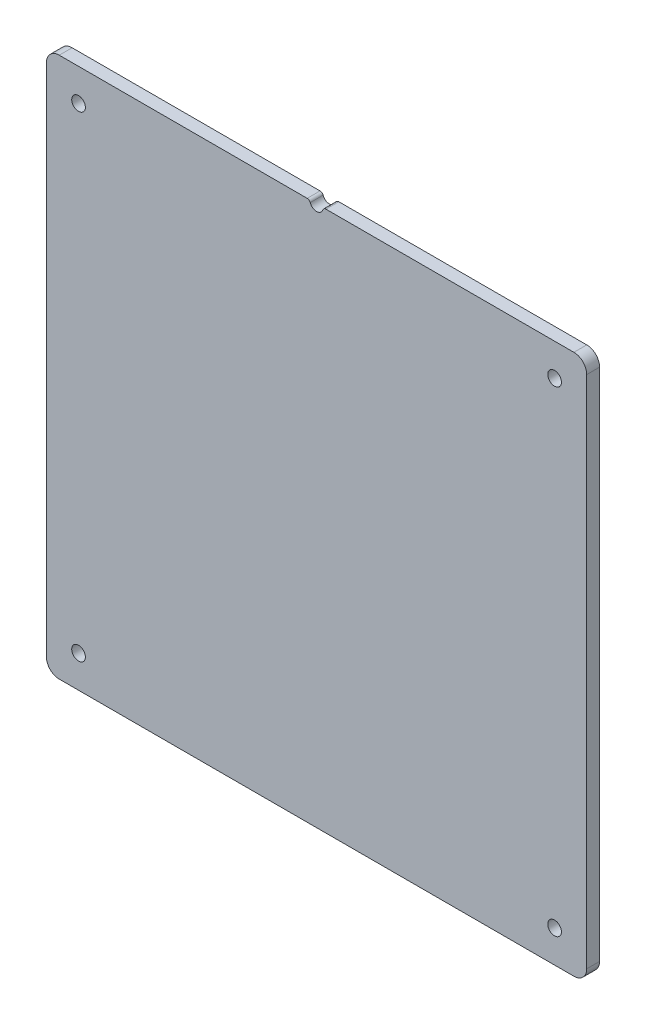
ISO-10303-21;
HEADER;
FILE_DESCRIPTION(('STEP AP214'),'2;1');
FILE_NAME('part.step','',(''),(''),'','','');
FILE_SCHEMA(('AUTOMOTIVE_DESIGN { 1 0 10303 214 1 1 1 1 }'));
ENDSEC;
DATA;
#1=APPLICATION_CONTEXT('core data for automotive mechanical design processes');
#2=APPLICATION_PROTOCOL_DEFINITION('international standard','automotive_design',2000,#1);
#3=PRODUCT_CONTEXT('',#1,'mechanical');
#4=PRODUCT('Part','Part','',(#3));
#5=PRODUCT_RELATED_PRODUCT_CATEGORY('part','',(#4));
#6=PRODUCT_DEFINITION_FORMATION('','',#4);
#7=PRODUCT_DEFINITION_CONTEXT('part definition',#1,'design');
#8=PRODUCT_DEFINITION('design','',#6,#7);
#9=PRODUCT_DEFINITION_SHAPE('','',#8);
#10=(LENGTH_UNIT() NAMED_UNIT(*) SI_UNIT(.MILLI.,.METRE.));
#11=(NAMED_UNIT(*) PLANE_ANGLE_UNIT() SI_UNIT($,.RADIAN.));
#12=(NAMED_UNIT(*) SI_UNIT($,.STERADIAN.) SOLID_ANGLE_UNIT());
#13=UNCERTAINTY_MEASURE_WITH_UNIT(LENGTH_MEASURE(1.E-05),#10,'distance_accuracy_value','');
#14=(GEOMETRIC_REPRESENTATION_CONTEXT(3) GLOBAL_UNCERTAINTY_ASSIGNED_CONTEXT((#13)) GLOBAL_UNIT_ASSIGNED_CONTEXT((#10,
#11,#12)) REPRESENTATION_CONTEXT('',''));
#15=CARTESIAN_POINT('',(0.,0.,0.));
#16=DIRECTION('',(0.,0.,1.));
#17=DIRECTION('',(1.,0.,0.));
#18=AXIS2_PLACEMENT_3D('',#15,#16,#17);
#19=CARTESIAN_POINT('',(-133.35,133.35,6.35));
#20=DIRECTION('',(0.,-1.,0.));
#21=DIRECTION('',(0.,0.,-1.));
#22=AXIS2_PLACEMENT_3D('',#19,#20,#21);
#23=PLANE('',#22);
#24=DIRECTION('',(-1.,0.,0.));
#25=VECTOR('',#24,1.);
#26=CARTESIAN_POINT('',(-133.35,133.35,0.));
#27=LINE('',#26,#25);
#28=CARTESIAN_POINT('',(127.,133.35,0.));
#29=VERTEX_POINT('',#28);
#30=CARTESIAN_POINT('',(4.6246139298324,133.35,0.));
#31=VERTEX_POINT('',#30);
#32=EDGE_CURVE('E163',#29,#31,#27,.T.);
#33=ORIENTED_EDGE('',*,*,#32,.T.);
#34=DIRECTION('',(0.,0.,1.));
#35=VECTOR('',#34,1.);
#36=CARTESIAN_POINT('',(4.6246139298324,133.35,6.35));
#37=LINE('',#36,#35);
#38=CARTESIAN_POINT('',(4.6246139298324,133.35,6.35));
#39=VERTEX_POINT('',#38);
#40=EDGE_CURVE('E205',#31,#39,#37,.T.);
#41=ORIENTED_EDGE('',*,*,#40,.T.);
#42=DIRECTION('',(-1.,0.,0.));
#43=VECTOR('',#42,1.);
#44=CARTESIAN_POINT('',(-133.35,133.35,6.35));
#45=LINE('',#44,#43);
#46=CARTESIAN_POINT('',(127.,133.35,6.35));
#47=VERTEX_POINT('',#46);
#48=EDGE_CURVE('E230',#47,#39,#45,.T.);
#49=ORIENTED_EDGE('',*,*,#48,.F.);
#50=DIRECTION('',(0.,0.,-1.));
#51=VECTOR('',#50,1.);
#52=CARTESIAN_POINT('',(127.,133.35,6.35));
#53=LINE('',#52,#51);
#54=EDGE_CURVE('E202',#47,#29,#53,.T.);
#55=ORIENTED_EDGE('',*,*,#54,.T.);
#56=EDGE_LOOP('',(#33,#41,#49,#55));
#57=FACE_BOUND('',#56,.T.);
#58=ADVANCED_FACE('F41',(#57),#23,.F.);
#59=CARTESIAN_POINT('',(0.,0.,6.35));
#60=DIRECTION('',(0.,0.,-1.));
#61=DIRECTION('',(-1.,0.,0.));
#62=AXIS2_PLACEMENT_3D('',#59,#60,#61);
#63=PLANE('',#62);
#64=CARTESIAN_POINT('',(-117.475,-117.475,6.35));
#65=DIRECTION('',(0.,0.,1.));
#66=DIRECTION('',(1.,0.,0.));
#67=AXIS2_PLACEMENT_3D('',#64,#65,#66);
#68=CIRCLE('',#67,3.37819999999998);
#69=CARTESIAN_POINT('',(-114.0968,-117.475,6.35));
#70=VERTEX_POINT('',#69);
#71=EDGE_CURVE('E241',#70,#70,#68,.T.);
#72=ORIENTED_EDGE('',*,*,#71,.F.);
#73=EDGE_LOOP('',(#72));
#74=FACE_BOUND('',#73,.T.);
#75=CARTESIAN_POINT('',(117.475,-117.475,6.35));
#76=DIRECTION('',(0.,0.,1.));
#77=DIRECTION('',(1.,0.,0.));
#78=AXIS2_PLACEMENT_3D('',#75,#76,#77);
#79=CIRCLE('',#78,3.37819999999998);
#80=CARTESIAN_POINT('',(120.8532,-117.475,6.35));
#81=VERTEX_POINT('',#80);
#82=EDGE_CURVE('E247',#81,#81,#79,.T.);
#83=ORIENTED_EDGE('',*,*,#82,.F.);
#84=EDGE_LOOP('',(#83));
#85=FACE_BOUND('',#84,.T.);
#86=CARTESIAN_POINT('',(117.475,117.475,6.35));
#87=DIRECTION('',(0.,0.,1.));
#88=DIRECTION('',(1.,0.,0.));
#89=AXIS2_PLACEMENT_3D('',#86,#87,#88);
#90=CIRCLE('',#89,3.37819999999998);
#91=CARTESIAN_POINT('',(120.8532,117.475,6.35));
#92=VERTEX_POINT('',#91);
#93=EDGE_CURVE('E166',#92,#92,#90,.T.);
#94=ORIENTED_EDGE('',*,*,#93,.F.);
#95=EDGE_LOOP('',(#94));
#96=FACE_BOUND('',#95,.T.);
#97=ORIENTED_EDGE('',*,*,#48,.T.);
#98=CARTESIAN_POINT('',(4.62461392983241,131.7625,6.35));
#99=DIRECTION('',(0.,0.,-1.));
#100=DIRECTION('',(-1.,0.,0.));
#101=AXIS2_PLACEMENT_3D('',#98,#99,#100);
#102=CIRCLE('',#101,1.5875);
#103=CARTESIAN_POINT('',(3.12311590066604,132.277922077922,6.35));
#104=VERTEX_POINT('',#103);
#105=EDGE_CURVE('E210',#39,#104,#102,.F.);
#106=ORIENTED_EDGE('',*,*,#105,.T.);
#107=CARTESIAN_POINT('',(0.,133.35,6.35));
#108=DIRECTION('',(0.,0.,1.));
#109=DIRECTION('',(1.,0.,0.));
#110=AXIS2_PLACEMENT_3D('',#107,#108,#109);
#111=CIRCLE('',#110,3.302);
#112=CARTESIAN_POINT('',(-3.12311590066604,132.277922077922,6.35));
#113=VERTEX_POINT('',#112);
#114=EDGE_CURVE('E228',#113,#104,#111,.T.);
#115=ORIENTED_EDGE('',*,*,#114,.F.);
#116=CARTESIAN_POINT('',(-4.62461392983241,131.7625,6.35));
#117=DIRECTION('',(0.,0.,-1.));
#118=DIRECTION('',(-1.,0.,0.));
#119=AXIS2_PLACEMENT_3D('',#116,#117,#118);
#120=CIRCLE('',#119,1.5875);
#121=CARTESIAN_POINT('',(-4.6246139298324,133.35,6.35));
#122=VERTEX_POINT('',#121);
#123=EDGE_CURVE('E208',#113,#122,#120,.F.);
#124=ORIENTED_EDGE('',*,*,#123,.T.);
#125=CARTESIAN_POINT('',(-127.,133.35,6.35));
#126=VERTEX_POINT('',#125);
#127=EDGE_CURVE('E256',#122,#126,#45,.T.);
#128=ORIENTED_EDGE('',*,*,#127,.T.);
#129=CARTESIAN_POINT('',(-127.,127.,6.35));
#130=DIRECTION('',(0.,0.,-1.));
#131=DIRECTION('',(-1.,0.,0.));
#132=AXIS2_PLACEMENT_3D('',#129,#130,#131);
#133=CIRCLE('',#132,6.35);
#134=CARTESIAN_POINT('',(-133.35,127.,6.35));
#135=VERTEX_POINT('',#134);
#136=EDGE_CURVE('E186',#126,#135,#133,.F.);
#137=ORIENTED_EDGE('',*,*,#136,.T.);
#138=DIRECTION('',(0.,-1.,0.));
#139=VECTOR('',#138,1.);
#140=CARTESIAN_POINT('',(-133.35,-133.35,6.35));
#141=LINE('',#140,#139);
#142=CARTESIAN_POINT('',(-133.35,-127.,6.35));
#143=VERTEX_POINT('',#142);
#144=EDGE_CURVE('E257',#135,#143,#141,.T.);
#145=ORIENTED_EDGE('',*,*,#144,.T.);
#146=CARTESIAN_POINT('',(-127.,-127.,6.35));
#147=DIRECTION('',(0.,0.,-1.));
#148=DIRECTION('',(-1.,0.,0.));
#149=AXIS2_PLACEMENT_3D('',#146,#147,#148);
#150=CIRCLE('',#149,6.35);
#151=CARTESIAN_POINT('',(-127.,-133.35,6.35));
#152=VERTEX_POINT('',#151);
#153=EDGE_CURVE('E190',#143,#152,#150,.F.);
#154=ORIENTED_EDGE('',*,*,#153,.T.);
#155=DIRECTION('',(1.,0.,0.));
#156=VECTOR('',#155,1.);
#157=CARTESIAN_POINT('',(-133.35,-133.35,6.35));
#158=LINE('',#157,#156);
#159=CARTESIAN_POINT('',(127.,-133.35,6.35));
#160=VERTEX_POINT('',#159);
#161=EDGE_CURVE('E169',#152,#160,#158,.T.);
#162=ORIENTED_EDGE('',*,*,#161,.T.);
#163=CARTESIAN_POINT('',(127.,-127.,6.35));
#164=DIRECTION('',(0.,0.,-1.));
#165=DIRECTION('',(-1.,0.,0.));
#166=AXIS2_PLACEMENT_3D('',#163,#164,#165);
#167=CIRCLE('',#166,6.35);
#168=CARTESIAN_POINT('',(133.35,-127.,6.35));
#169=VERTEX_POINT('',#168);
#170=EDGE_CURVE('E192',#160,#169,#167,.F.);
#171=ORIENTED_EDGE('',*,*,#170,.T.);
#172=DIRECTION('',(0.,1.,0.));
#173=VECTOR('',#172,1.);
#174=CARTESIAN_POINT('',(133.35,-133.35,6.35));
#175=LINE('',#174,#173);
#176=CARTESIAN_POINT('',(133.35,127.,6.35));
#177=VERTEX_POINT('',#176);
#178=EDGE_CURVE('E152',#169,#177,#175,.T.);
#179=ORIENTED_EDGE('',*,*,#178,.T.);
#180=CARTESIAN_POINT('',(127.,127.,6.35));
#181=DIRECTION('',(0.,0.,-1.));
#182=DIRECTION('',(-1.,0.,0.));
#183=AXIS2_PLACEMENT_3D('',#180,#181,#182);
#184=CIRCLE('',#183,6.35);
#185=EDGE_CURVE('E188',#177,#47,#184,.F.);
#186=ORIENTED_EDGE('',*,*,#185,.T.);
#187=EDGE_LOOP('',(#97,#106,#115,#124,#128,#137,#145,#154,#162,#171,#179,#186));
#188=FACE_BOUND('',#187,.T.);
#189=CARTESIAN_POINT('',(-117.475,117.475,6.35));
#190=DIRECTION('',(0.,0.,1.));
#191=DIRECTION('',(1.,0.,0.));
#192=AXIS2_PLACEMENT_3D('',#189,#190,#191);
#193=CIRCLE('',#192,3.37819999999998);
#194=CARTESIAN_POINT('',(-114.0968,117.475,6.35));
#195=VERTEX_POINT('',#194);
#196=EDGE_CURVE('E233',#195,#195,#193,.T.);
#197=ORIENTED_EDGE('',*,*,#196,.F.);
#198=EDGE_LOOP('',(#197));
#199=FACE_BOUND('',#198,.T.);
#200=ADVANCED_FACE('F226',(#74,#85,#96,#188,#199),#63,.F.);
#201=CARTESIAN_POINT('',(0.,0.,0.));
#202=DIRECTION('',(0.,0.,-1.));
#203=DIRECTION('',(-1.,0.,0.));
#204=AXIS2_PLACEMENT_3D('',#201,#202,#203);
#205=PLANE('',#204);
#206=CARTESIAN_POINT('',(0.,133.35,0.));
#207=DIRECTION('',(0.,0.,1.));
#208=DIRECTION('',(1.,0.,0.));
#209=AXIS2_PLACEMENT_3D('',#206,#207,#208);
#210=CIRCLE('',#209,3.302);
#211=CARTESIAN_POINT('',(-3.12311590066604,132.277922077922,0.));
#212=VERTEX_POINT('',#211);
#213=CARTESIAN_POINT('',(3.12311590066604,132.277922077922,0.));
#214=VERTEX_POINT('',#213);
#215=EDGE_CURVE('E216',#212,#214,#210,.T.);
#216=ORIENTED_EDGE('',*,*,#215,.T.);
#217=CARTESIAN_POINT('',(4.62461392983241,131.7625,0.));
#218=DIRECTION('',(0.,0.,-1.));
#219=DIRECTION('',(-1.,0.,0.));
#220=AXIS2_PLACEMENT_3D('',#217,#218,#219);
#221=CIRCLE('',#220,1.5875);
#222=EDGE_CURVE('E49',#214,#31,#221,.T.);
#223=ORIENTED_EDGE('',*,*,#222,.T.);
#224=ORIENTED_EDGE('',*,*,#32,.F.);
#225=CARTESIAN_POINT('',(127.,127.,0.));
#226=DIRECTION('',(0.,0.,-1.));
#227=DIRECTION('',(-1.,0.,0.));
#228=AXIS2_PLACEMENT_3D('',#225,#226,#227);
#229=CIRCLE('',#228,6.35);
#230=CARTESIAN_POINT('',(133.35,127.,0.));
#231=VERTEX_POINT('',#230);
#232=EDGE_CURVE('E159',#29,#231,#229,.T.);
#233=ORIENTED_EDGE('',*,*,#232,.T.);
#234=DIRECTION('',(0.,1.,0.));
#235=VECTOR('',#234,1.);
#236=CARTESIAN_POINT('',(133.35,-133.35,0.));
#237=LINE('',#236,#235);
#238=CARTESIAN_POINT('',(133.35,-127.,0.));
#239=VERTEX_POINT('',#238);
#240=EDGE_CURVE('E149',#239,#231,#237,.T.);
#241=ORIENTED_EDGE('',*,*,#240,.F.);
#242=CARTESIAN_POINT('',(127.,-127.,0.));
#243=DIRECTION('',(0.,0.,-1.));
#244=DIRECTION('',(-1.,0.,0.));
#245=AXIS2_PLACEMENT_3D('',#242,#243,#244);
#246=CIRCLE('',#245,6.35);
#247=CARTESIAN_POINT('',(127.,-133.35,0.));
#248=VERTEX_POINT('',#247);
#249=EDGE_CURVE('E132',#239,#248,#246,.T.);
#250=ORIENTED_EDGE('',*,*,#249,.T.);
#251=DIRECTION('',(1.,0.,0.));
#252=VECTOR('',#251,1.);
#253=CARTESIAN_POINT('',(-133.35,-133.35,0.));
#254=LINE('',#253,#252);
#255=CARTESIAN_POINT('',(-127.,-133.35,0.));
#256=VERTEX_POINT('',#255);
#257=EDGE_CURVE('E176',#256,#248,#254,.T.);
#258=ORIENTED_EDGE('',*,*,#257,.F.);
#259=CARTESIAN_POINT('',(-127.,-127.,0.));
#260=DIRECTION('',(0.,0.,-1.));
#261=DIRECTION('',(-1.,0.,0.));
#262=AXIS2_PLACEMENT_3D('',#259,#260,#261);
#263=CIRCLE('',#262,6.35);
#264=CARTESIAN_POINT('',(-133.35,-127.,0.));
#265=VERTEX_POINT('',#264);
#266=EDGE_CURVE('E143',#256,#265,#263,.T.);
#267=ORIENTED_EDGE('',*,*,#266,.T.);
#268=DIRECTION('',(0.,-1.,0.));
#269=VECTOR('',#268,1.);
#270=CARTESIAN_POINT('',(-133.35,-133.35,0.));
#271=LINE('',#270,#269);
#272=CARTESIAN_POINT('',(-133.35,127.,0.));
#273=VERTEX_POINT('',#272);
#274=EDGE_CURVE('E173',#273,#265,#271,.T.);
#275=ORIENTED_EDGE('',*,*,#274,.F.);
#276=CARTESIAN_POINT('',(-127.,127.,0.));
#277=DIRECTION('',(0.,0.,-1.));
#278=DIRECTION('',(-1.,0.,0.));
#279=AXIS2_PLACEMENT_3D('',#276,#277,#278);
#280=CIRCLE('',#279,6.35);
#281=CARTESIAN_POINT('',(-127.,133.35,0.));
#282=VERTEX_POINT('',#281);
#283=EDGE_CURVE('E153',#273,#282,#280,.T.);
#284=ORIENTED_EDGE('',*,*,#283,.T.);
#285=CARTESIAN_POINT('',(-4.6246139298324,133.35,0.));
#286=VERTEX_POINT('',#285);
#287=EDGE_CURVE('E160',#286,#282,#27,.T.);
#288=ORIENTED_EDGE('',*,*,#287,.F.);
#289=CARTESIAN_POINT('',(-4.62461392983241,131.7625,0.));
#290=DIRECTION('',(0.,0.,-1.));
#291=DIRECTION('',(-1.,0.,0.));
#292=AXIS2_PLACEMENT_3D('',#289,#290,#291);
#293=CIRCLE('',#292,1.5875);
#294=EDGE_CURVE('E56',#286,#212,#293,.T.);
#295=ORIENTED_EDGE('',*,*,#294,.T.);
#296=EDGE_LOOP('',(#216,#223,#224,#233,#241,#250,#258,#267,#275,#284,#288,#295));
#297=FACE_BOUND('',#296,.T.);
#298=CARTESIAN_POINT('',(-117.475,117.475,0.));
#299=DIRECTION('',(0.,0.,1.));
#300=DIRECTION('',(1.,0.,0.));
#301=AXIS2_PLACEMENT_3D('',#298,#299,#300);
#302=CIRCLE('',#301,3.37819999999993);
#303=CARTESIAN_POINT('',(-114.0968,117.475,0.));
#304=VERTEX_POINT('',#303);
#305=EDGE_CURVE('E238',#304,#304,#302,.T.);
#306=ORIENTED_EDGE('',*,*,#305,.T.);
#307=EDGE_LOOP('',(#306));
#308=FACE_BOUND('',#307,.T.);
#309=CARTESIAN_POINT('',(-117.475,-117.475,0.));
#310=DIRECTION('',(0.,0.,1.));
#311=DIRECTION('',(1.,0.,0.));
#312=AXIS2_PLACEMENT_3D('',#309,#310,#311);
#313=CIRCLE('',#312,3.37819999999993);
#314=CARTESIAN_POINT('',(-114.0968,-117.475,0.));
#315=VERTEX_POINT('',#314);
#316=EDGE_CURVE('E244',#315,#315,#313,.T.);
#317=ORIENTED_EDGE('',*,*,#316,.T.);
#318=EDGE_LOOP('',(#317));
#319=FACE_BOUND('',#318,.T.);
#320=CARTESIAN_POINT('',(117.475,117.475,0.));
#321=DIRECTION('',(0.,0.,1.));
#322=DIRECTION('',(1.,0.,0.));
#323=AXIS2_PLACEMENT_3D('',#320,#321,#322);
#324=CIRCLE('',#323,3.37819999999993);
#325=CARTESIAN_POINT('',(120.8532,117.475,0.));
#326=VERTEX_POINT('',#325);
#327=EDGE_CURVE('E161',#326,#326,#324,.T.);
#328=ORIENTED_EDGE('',*,*,#327,.T.);
#329=EDGE_LOOP('',(#328));
#330=FACE_BOUND('',#329,.T.);
#331=CARTESIAN_POINT('',(117.475,-117.475,0.));
#332=DIRECTION('',(0.,0.,1.));
#333=DIRECTION('',(1.,0.,0.));
#334=AXIS2_PLACEMENT_3D('',#331,#332,#333);
#335=CIRCLE('',#334,3.37819999999993);
#336=CARTESIAN_POINT('',(120.8532,-117.475,0.));
#337=VERTEX_POINT('',#336);
#338=EDGE_CURVE('E250',#337,#337,#335,.T.);
#339=ORIENTED_EDGE('',*,*,#338,.T.);
#340=EDGE_LOOP('',(#339));
#341=FACE_BOUND('',#340,.T.);
#342=ADVANCED_FACE('F156',(#297,#308,#319,#330,#341),#205,.T.);
#343=CARTESIAN_POINT('',(133.35,-133.35,6.35));
#344=DIRECTION('',(-1.,0.,0.));
#345=DIRECTION('',(0.,0.,1.));
#346=AXIS2_PLACEMENT_3D('',#343,#344,#345);
#347=PLANE('',#346);
#348=ORIENTED_EDGE('',*,*,#178,.F.);
#349=DIRECTION('',(0.,0.,-1.));
#350=VECTOR('',#349,1.);
#351=CARTESIAN_POINT('',(133.35,-127.,6.35));
#352=LINE('',#351,#350);
#353=EDGE_CURVE('E136',#169,#239,#352,.T.);
#354=ORIENTED_EDGE('',*,*,#353,.T.);
#355=ORIENTED_EDGE('',*,*,#240,.T.);
#356=DIRECTION('',(0.,0.,-1.));
#357=VECTOR('',#356,1.);
#358=CARTESIAN_POINT('',(133.35,127.,6.35));
#359=LINE('',#358,#357);
#360=EDGE_CURVE('E154',#231,#177,#359,.F.);
#361=ORIENTED_EDGE('',*,*,#360,.T.);
#362=EDGE_LOOP('',(#348,#354,#355,#361));
#363=FACE_BOUND('',#362,.T.);
#364=ADVANCED_FACE('F148',(#363),#347,.F.);
#365=ORIENTED_EDGE('',*,*,#127,.F.);
#366=DIRECTION('',(0.,0.,1.));
#367=VECTOR('',#366,1.);
#368=CARTESIAN_POINT('',(-4.6246139298324,133.35,6.35));
#369=LINE('',#368,#367);
#370=EDGE_CURVE('E11',#122,#286,#369,.F.);
#371=ORIENTED_EDGE('',*,*,#370,.T.);
#372=ORIENTED_EDGE('',*,*,#287,.T.);
#373=DIRECTION('',(0.,0.,-1.));
#374=VECTOR('',#373,1.);
#375=CARTESIAN_POINT('',(-127.,133.35,6.35));
#376=LINE('',#375,#374);
#377=EDGE_CURVE('E199',#282,#126,#376,.F.);
#378=ORIENTED_EDGE('',*,*,#377,.T.);
#379=EDGE_LOOP('',(#365,#371,#372,#378));
#380=FACE_BOUND('',#379,.T.);
#381=ADVANCED_FACE('F280',(#380),#23,.F.);
#382=CARTESIAN_POINT('',(-133.35,-133.35,6.35));
#383=DIRECTION('',(1.,0.,0.));
#384=DIRECTION('',(0.,0.,-1.));
#385=AXIS2_PLACEMENT_3D('',#382,#383,#384);
#386=PLANE('',#385);
#387=ORIENTED_EDGE('',*,*,#274,.T.);
#388=DIRECTION('',(0.,0.,-1.));
#389=VECTOR('',#388,1.);
#390=CARTESIAN_POINT('',(-133.35,-127.,6.35));
#391=LINE('',#390,#389);
#392=EDGE_CURVE('E197',#265,#143,#391,.F.);
#393=ORIENTED_EDGE('',*,*,#392,.T.);
#394=ORIENTED_EDGE('',*,*,#144,.F.);
#395=DIRECTION('',(0.,0.,-1.));
#396=VECTOR('',#395,1.);
#397=CARTESIAN_POINT('',(-133.35,127.,6.35));
#398=LINE('',#397,#396);
#399=EDGE_CURVE('E194',#135,#273,#398,.T.);
#400=ORIENTED_EDGE('',*,*,#399,.T.);
#401=EDGE_LOOP('',(#387,#393,#394,#400));
#402=FACE_BOUND('',#401,.T.);
#403=ADVANCED_FACE('F271',(#402),#386,.F.);
#404=CARTESIAN_POINT('',(-133.35,-133.35,6.35));
#405=DIRECTION('',(0.,1.,0.));
#406=DIRECTION('',(0.,0.,1.));
#407=AXIS2_PLACEMENT_3D('',#404,#405,#406);
#408=PLANE('',#407);
#409=ORIENTED_EDGE('',*,*,#257,.T.);
#410=DIRECTION('',(0.,0.,-1.));
#411=VECTOR('',#410,1.);
#412=CARTESIAN_POINT('',(127.,-133.35,6.35));
#413=LINE('',#412,#411);
#414=EDGE_CURVE('E137',#248,#160,#413,.F.);
#415=ORIENTED_EDGE('',*,*,#414,.T.);
#416=ORIENTED_EDGE('',*,*,#161,.F.);
#417=DIRECTION('',(0.,0.,-1.));
#418=VECTOR('',#417,1.);
#419=CARTESIAN_POINT('',(-127.,-133.35,6.35));
#420=LINE('',#419,#418);
#421=EDGE_CURVE('E142',#152,#256,#420,.T.);
#422=ORIENTED_EDGE('',*,*,#421,.T.);
#423=EDGE_LOOP('',(#409,#415,#416,#422));
#424=FACE_BOUND('',#423,.T.);
#425=ADVANCED_FACE('F265',(#424),#408,.F.);
#426=CARTESIAN_POINT('',(117.475,117.475,6.35));
#427=DIRECTION('',(0.,0.,1.));
#428=DIRECTION('',(1.,0.,0.));
#429=AXIS2_PLACEMENT_3D('',#426,#427,#428);
#430=CYLINDRICAL_SURFACE('',#429,3.37819999999996);
#431=ORIENTED_EDGE('',*,*,#327,.F.);
#432=EDGE_LOOP('',(#431));
#433=FACE_BOUND('',#432,.T.);
#434=ORIENTED_EDGE('',*,*,#93,.T.);
#435=EDGE_LOOP('',(#434));
#436=FACE_BOUND('',#435,.T.);
#437=ADVANCED_FACE('F331',(#433,#436),#430,.F.);
#438=CARTESIAN_POINT('',(117.475,-117.475,6.35));
#439=DIRECTION('',(0.,0.,1.));
#440=DIRECTION('',(1.,0.,0.));
#441=AXIS2_PLACEMENT_3D('',#438,#439,#440);
#442=CYLINDRICAL_SURFACE('',#441,3.37819999999996);
#443=ORIENTED_EDGE('',*,*,#338,.F.);
#444=EDGE_LOOP('',(#443));
#445=FACE_BOUND('',#444,.T.);
#446=ORIENTED_EDGE('',*,*,#82,.T.);
#447=EDGE_LOOP('',(#446));
#448=FACE_BOUND('',#447,.T.);
#449=ADVANCED_FACE('F327',(#445,#448),#442,.F.);
#450=CARTESIAN_POINT('',(-117.475,-117.475,6.35));
#451=DIRECTION('',(0.,0.,1.));
#452=DIRECTION('',(1.,0.,0.));
#453=AXIS2_PLACEMENT_3D('',#450,#451,#452);
#454=CYLINDRICAL_SURFACE('',#453,3.37819999999996);
#455=ORIENTED_EDGE('',*,*,#316,.F.);
#456=EDGE_LOOP('',(#455));
#457=FACE_BOUND('',#456,.T.);
#458=ORIENTED_EDGE('',*,*,#71,.T.);
#459=EDGE_LOOP('',(#458));
#460=FACE_BOUND('',#459,.T.);
#461=ADVANCED_FACE('F323',(#457,#460),#454,.F.);
#462=CARTESIAN_POINT('',(-117.475,117.475,6.35));
#463=DIRECTION('',(0.,0.,1.));
#464=DIRECTION('',(1.,0.,0.));
#465=AXIS2_PLACEMENT_3D('',#462,#463,#464);
#466=CYLINDRICAL_SURFACE('',#465,3.37819999999996);
#467=ORIENTED_EDGE('',*,*,#305,.F.);
#468=EDGE_LOOP('',(#467));
#469=FACE_BOUND('',#468,.T.);
#470=ORIENTED_EDGE('',*,*,#196,.T.);
#471=EDGE_LOOP('',(#470));
#472=FACE_BOUND('',#471,.T.);
#473=ADVANCED_FACE('F309',(#469,#472),#466,.F.);
#474=CARTESIAN_POINT('',(127.,-127.,6.35));
#475=DIRECTION('',(0.,0.,-1.));
#476=DIRECTION('',(-1.,0.,0.));
#477=AXIS2_PLACEMENT_3D('',#474,#475,#476);
#478=CYLINDRICAL_SURFACE('',#477,6.35);
#479=ORIENTED_EDGE('',*,*,#170,.F.);
#480=ORIENTED_EDGE('',*,*,#414,.F.);
#481=ORIENTED_EDGE('',*,*,#249,.F.);
#482=ORIENTED_EDGE('',*,*,#353,.F.);
#483=EDGE_LOOP('',(#479,#480,#481,#482));
#484=FACE_BOUND('',#483,.T.);
#485=ADVANCED_FACE('F135',(#484),#478,.T.);
#486=CARTESIAN_POINT('',(-127.,-127.,6.35));
#487=DIRECTION('',(0.,0.,-1.));
#488=DIRECTION('',(-1.,0.,0.));
#489=AXIS2_PLACEMENT_3D('',#486,#487,#488);
#490=CYLINDRICAL_SURFACE('',#489,6.35);
#491=ORIENTED_EDGE('',*,*,#153,.F.);
#492=ORIENTED_EDGE('',*,*,#392,.F.);
#493=ORIENTED_EDGE('',*,*,#266,.F.);
#494=ORIENTED_EDGE('',*,*,#421,.F.);
#495=EDGE_LOOP('',(#491,#492,#493,#494));
#496=FACE_BOUND('',#495,.T.);
#497=ADVANCED_FACE('F267',(#496),#490,.T.);
#498=CARTESIAN_POINT('',(127.,127.,6.35));
#499=DIRECTION('',(0.,0.,-1.));
#500=DIRECTION('',(-1.,0.,0.));
#501=AXIS2_PLACEMENT_3D('',#498,#499,#500);
#502=CYLINDRICAL_SURFACE('',#501,6.35);
#503=ORIENTED_EDGE('',*,*,#185,.F.);
#504=ORIENTED_EDGE('',*,*,#360,.F.);
#505=ORIENTED_EDGE('',*,*,#232,.F.);
#506=ORIENTED_EDGE('',*,*,#54,.F.);
#507=EDGE_LOOP('',(#503,#504,#505,#506));
#508=FACE_BOUND('',#507,.T.);
#509=ADVANCED_FACE('F312',(#508),#502,.T.);
#510=CARTESIAN_POINT('',(-127.,127.,6.35));
#511=DIRECTION('',(0.,0.,-1.));
#512=DIRECTION('',(-1.,0.,0.));
#513=AXIS2_PLACEMENT_3D('',#510,#511,#512);
#514=CYLINDRICAL_SURFACE('',#513,6.35);
#515=ORIENTED_EDGE('',*,*,#136,.F.);
#516=ORIENTED_EDGE('',*,*,#377,.F.);
#517=ORIENTED_EDGE('',*,*,#283,.F.);
#518=ORIENTED_EDGE('',*,*,#399,.F.);
#519=EDGE_LOOP('',(#515,#516,#517,#518));
#520=FACE_BOUND('',#519,.T.);
#521=ADVANCED_FACE('F275',(#520),#514,.T.);
#522=CARTESIAN_POINT('',(0.,133.35,0.));
#523=DIRECTION('',(0.,0.,1.));
#524=DIRECTION('',(1.,0.,0.));
#525=AXIS2_PLACEMENT_3D('',#522,#523,#524);
#526=CYLINDRICAL_SURFACE('',#525,3.302);
#527=ORIENTED_EDGE('',*,*,#114,.T.);
#528=DIRECTION('',(0.,0.,1.));
#529=VECTOR('',#528,1.);
#530=CARTESIAN_POINT('',(3.12311590066605,132.277922077922,0.));
#531=LINE('',#530,#529);
#532=EDGE_CURVE('E63',#104,#214,#531,.F.);
#533=ORIENTED_EDGE('',*,*,#532,.T.);
#534=ORIENTED_EDGE('',*,*,#215,.F.);
#535=DIRECTION('',(0.,0.,1.));
#536=VECTOR('',#535,1.);
#537=CARTESIAN_POINT('',(-3.12311590066605,132.277922077922,0.));
#538=LINE('',#537,#536);
#539=EDGE_CURVE('E212',#212,#113,#538,.T.);
#540=ORIENTED_EDGE('',*,*,#539,.T.);
#541=EDGE_LOOP('',(#527,#533,#534,#540));
#542=FACE_BOUND('',#541,.T.);
#543=ADVANCED_FACE('F231',(#542),#526,.F.);
#544=CARTESIAN_POINT('',(4.62461392983241,131.7625,0.));
#545=DIRECTION('',(0.,0.,1.));
#546=DIRECTION('',(1.,0.,0.));
#547=AXIS2_PLACEMENT_3D('',#544,#545,#546);
#548=CYLINDRICAL_SURFACE('',#547,1.5875);
#549=ORIENTED_EDGE('',*,*,#222,.F.);
#550=ORIENTED_EDGE('',*,*,#532,.F.);
#551=ORIENTED_EDGE('',*,*,#105,.F.);
#552=ORIENTED_EDGE('',*,*,#40,.F.);
#553=EDGE_LOOP('',(#549,#550,#551,#552));
#554=FACE_BOUND('',#553,.T.);
#555=ADVANCED_FACE('F223',(#554),#548,.T.);
#556=CARTESIAN_POINT('',(-4.62461392983241,131.7625,0.));
#557=DIRECTION('',(0.,0.,1.));
#558=DIRECTION('',(1.,0.,0.));
#559=AXIS2_PLACEMENT_3D('',#556,#557,#558);
#560=CYLINDRICAL_SURFACE('',#559,1.5875);
#561=ORIENTED_EDGE('',*,*,#123,.F.);
#562=ORIENTED_EDGE('',*,*,#539,.F.);
#563=ORIENTED_EDGE('',*,*,#294,.F.);
#564=ORIENTED_EDGE('',*,*,#370,.F.);
#565=EDGE_LOOP('',(#561,#562,#563,#564));
#566=FACE_BOUND('',#565,.T.);
#567=ADVANCED_FACE('F43',(#566),#560,.T.);
#568=CLOSED_SHELL('',(#58,#200,#342,#364,#381,#403,#425,#437,#449,#461,#473,#485,#497,#509,#521,
#543,#555,#567));
#569=MANIFOLD_SOLID_BREP('B2',#568);
#570=ADVANCED_BREP_SHAPE_REPRESENTATION('',(#18,#569),#14);
#571=SHAPE_DEFINITION_REPRESENTATION(#9,#570);
ENDSEC;
END-ISO-10303-21;
